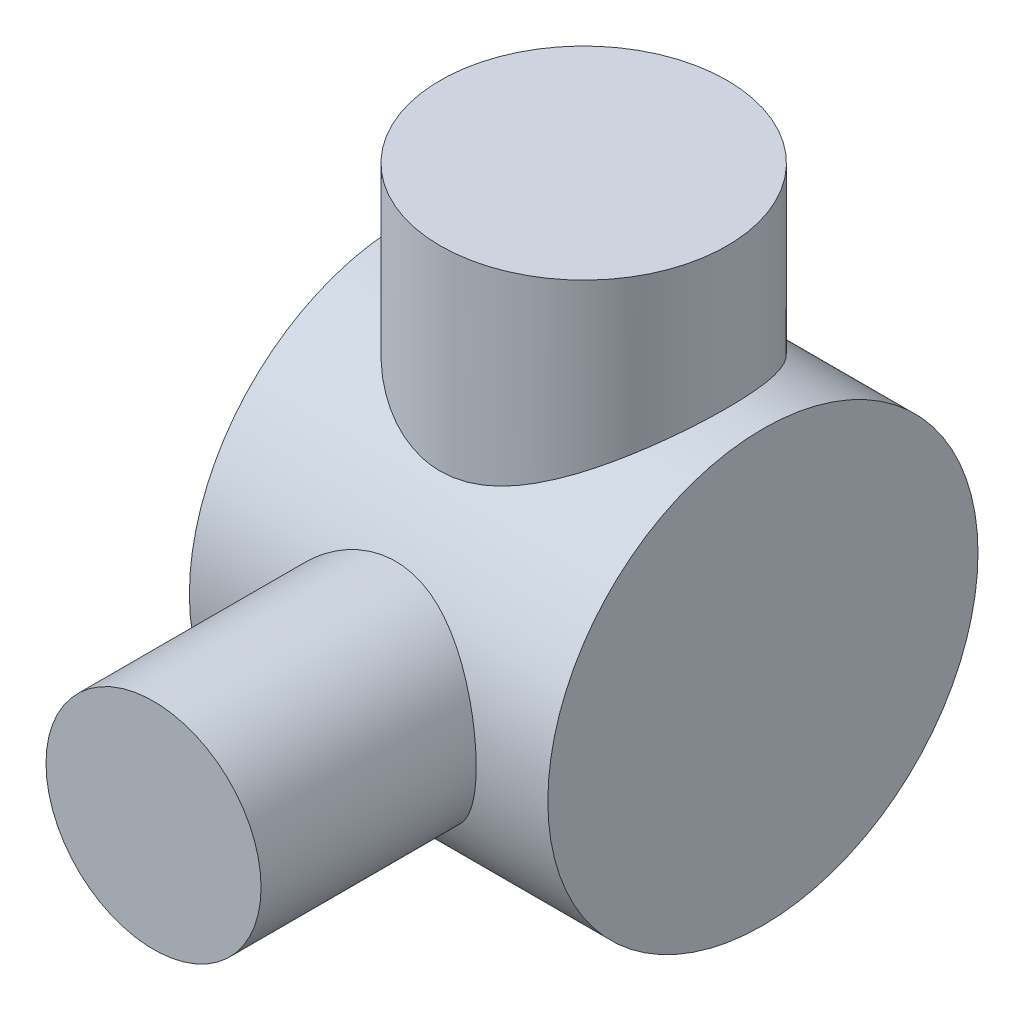
ISO-10303-21;
HEADER;
FILE_DESCRIPTION(('STEP AP214'),'2;1');
FILE_NAME('part.step','',(''),(''),'','','');
FILE_SCHEMA(('AUTOMOTIVE_DESIGN { 1 0 10303 214 1 1 1 1 }'));
ENDSEC;
DATA;
#1=APPLICATION_CONTEXT('core data for automotive mechanical design processes');
#2=APPLICATION_PROTOCOL_DEFINITION('international standard','automotive_design',2000,#1);
#3=PRODUCT_CONTEXT('',#1,'mechanical');
#4=PRODUCT('Part','Part','',(#3));
#5=PRODUCT_RELATED_PRODUCT_CATEGORY('part','',(#4));
#6=PRODUCT_DEFINITION_FORMATION('','',#4);
#7=PRODUCT_DEFINITION_CONTEXT('part definition',#1,'design');
#8=PRODUCT_DEFINITION('design','',#6,#7);
#9=PRODUCT_DEFINITION_SHAPE('','',#8);
#10=(LENGTH_UNIT() NAMED_UNIT(*) SI_UNIT(.MILLI.,.METRE.));
#11=(NAMED_UNIT(*) PLANE_ANGLE_UNIT() SI_UNIT($,.RADIAN.));
#12=(NAMED_UNIT(*) SI_UNIT($,.STERADIAN.) SOLID_ANGLE_UNIT());
#13=UNCERTAINTY_MEASURE_WITH_UNIT(LENGTH_MEASURE(1.E-05),#10,'distance_accuracy_value','');
#14=(GEOMETRIC_REPRESENTATION_CONTEXT(3) GLOBAL_UNCERTAINTY_ASSIGNED_CONTEXT((#13)) GLOBAL_UNIT_ASSIGNED_CONTEXT((#10,
#11,#12)) REPRESENTATION_CONTEXT('',''));
#15=CARTESIAN_POINT('',(0.,0.,0.));
#16=DIRECTION('',(0.,0.,1.));
#17=DIRECTION('',(1.,0.,0.));
#18=AXIS2_PLACEMENT_3D('',#15,#16,#17);
#19=CARTESIAN_POINT('',(0.,-50.,60.));
#20=DIRECTION('',(0.,0.,-1.));
#21=DIRECTION('',(-1.,0.,0.));
#22=AXIS2_PLACEMENT_3D('',#19,#20,#21);
#23=CYLINDRICAL_SURFACE('',#22,15.);
#24=CARTESIAN_POINT('',(0.,-50.,60.));
#25=DIRECTION('',(0.,0.,1.));
#26=DIRECTION('',(1.,0.,0.));
#27=AXIS2_PLACEMENT_3D('',#24,#25,#26);
#28=CIRCLE('',#27,15.);
#29=CARTESIAN_POINT('',(15.,-50.,60.));
#30=VERTEX_POINT('',#29);
#31=EDGE_CURVE('E11',#30,#30,#28,.T.);
#32=ORIENTED_EDGE('',*,*,#31,.F.);
#33=EDGE_LOOP('',(#32));
#34=FACE_BOUND('',#33,.T.);
#35=CARTESIAN_POINT('',(15.,-50.,29.9972154904954));
#36=CARTESIAN_POINT('',(14.9999989569117,-49.6068954014269,30.0025708522421));
#37=CARTESIAN_POINT('',(14.9845295123819,-49.2136627414613,30.0001834044916));
#38=CARTESIAN_POINT('',(14.9227783544598,-48.4298703688785,29.9800756600959));
#39=CARTESIAN_POINT('',(14.876483692889,-48.0393118492168,29.9623489192199));
#40=CARTESIAN_POINT('',(14.7534826368118,-47.2633382905676,29.912073871456));
#41=CARTESIAN_POINT('',(14.6767270639014,-46.8779326159672,29.8795015841057));
#42=CARTESIAN_POINT('',(14.4936538265207,-46.1157217811783,29.8004596578945));
#43=CARTESIAN_POINT('',(14.3873390216789,-45.7389157928501,29.7539913633328));
#44=CARTESIAN_POINT('',(14.1466892645879,-44.9977569546474,29.6485964235089));
#45=CARTESIAN_POINT('',(14.0124603619356,-44.6333628785264,29.5897169189796));
#46=CARTESIAN_POINT('',(13.7169944353529,-43.9177360106304,29.4608766035774));
#47=CARTESIAN_POINT('',(13.5557568384866,-43.5665034982454,29.3909155576333));
#48=CARTESIAN_POINT('',(13.2076811372139,-42.8792208762474,29.2416154302373));
#49=CARTESIAN_POINT('',(13.020851993918,-42.5431655067512,29.1622796327687));
#50=CARTESIAN_POINT('',(12.6228455298096,-41.8876091641929,28.9960010129632));
#51=CARTESIAN_POINT('',(12.4116586135258,-41.568114787479,28.9090551960191));
#52=CARTESIAN_POINT('',(11.9535809078084,-40.9294401936825,28.7243711256223));
#53=CARTESIAN_POINT('',(11.7053380463562,-40.6113257772543,28.6262999607597));
#54=CARTESIAN_POINT('',(11.1847318351996,-39.9968021929478,28.4262324494229));
#55=CARTESIAN_POINT('',(10.9123671046137,-39.7003942694571,28.324235878424));
#56=CARTESIAN_POINT('',(10.3448278255045,-39.1304852062085,28.1187457345628));
#57=CARTESIAN_POINT('',(10.0496401912575,-38.8569973979917,28.0152513309599));
#58=CARTESIAN_POINT('',(9.43797326936917,-38.3343875274729,27.8093792427744));
#59=CARTESIAN_POINT('',(9.12149006296054,-38.0852699705444,27.707001767777));
#60=CARTESIAN_POINT('',(8.44325665145162,-37.5943547143076,27.4981942905967));
#61=CARTESIAN_POINT('',(8.07990072555806,-37.3546393051382,27.3920699490561));
#62=CARTESIAN_POINT('',(7.33223896903544,-36.9069467951423,27.187654988409));
#63=CARTESIAN_POINT('',(6.94794188990345,-36.6989565720573,27.0893611385139));
#64=CARTESIAN_POINT('',(6.16051849684818,-36.3164502994685,26.9039854629751));
#65=CARTESIAN_POINT('',(5.75739655781988,-36.141926520038,26.8169010497582));
#66=CARTESIAN_POINT('',(4.93486257246805,-35.8281681161926,26.6572344182085));
#67=CARTESIAN_POINT('',(4.51545213989069,-35.6889300061622,26.5846507676007));
#68=CARTESIAN_POINT('',(3.6860691904766,-35.4539114566969,26.4603840007933));
#69=CARTESIAN_POINT('',(3.27677481981684,-35.3562186906283,26.4077969563355));
#70=CARTESIAN_POINT('',(2.44956087213642,-35.195367437884,26.3204577580377));
#71=CARTESIAN_POINT('',(2.03164161561104,-35.1322076703731,26.285704942726));
#72=CARTESIAN_POINT('',(1.19113989541962,-35.0413999992032,26.235549941696));
#73=CARTESIAN_POINT('',(0.768561457126202,-35.0137235449851,26.2201321988237));
#74=CARTESIAN_POINT('',(-0.0776610307218568,-34.994233233378,26.2092876499163));
#75=CARTESIAN_POINT('',(-0.501304979874221,-35.0024161148474,26.2138590260186));
#76=CARTESIAN_POINT('',(-1.2977996236505,-35.0515406874721,26.2411316059561));
#77=CARTESIAN_POINT('',(-1.67096621046526,-35.0886652170492,26.2617197159004));
#78=CARTESIAN_POINT('',(-2.41235045676477,-35.1905251540266,26.3177130358913));
#79=CARTESIAN_POINT('',(-2.78056854785173,-35.2552581371144,26.3531169449498));
#80=CARTESIAN_POINT('',(-3.50972132508105,-35.4116163333403,26.4375752528457));
#81=CARTESIAN_POINT('',(-3.87065428923304,-35.5032478267497,26.4866328394084));
#82=CARTESIAN_POINT('',(-4.58301874056562,-35.7124611049077,26.5968553309562));
#83=CARTESIAN_POINT('',(-4.9344497504026,-35.8300441906611,26.6580208429198));
#84=CARTESIAN_POINT('',(-5.6329987355544,-36.092757060446,26.7920212417417));
#85=CARTESIAN_POINT('',(-5.97988273323855,-36.2383995467559,26.8650686013772));
#86=CARTESIAN_POINT('',(-6.66026852302998,-36.5544952002418,27.0198732623772));
#87=CARTESIAN_POINT('',(-6.99376546633247,-36.7249572554756,27.101633681124));
#88=CARTESIAN_POINT('',(-7.64587546903434,-37.0895331392291,27.2717272823899));
#89=CARTESIAN_POINT('',(-7.96448615605696,-37.283650719991,27.3600615067794));
#90=CARTESIAN_POINT('',(-8.58552414750742,-37.6944157225287,27.541156769362));
#91=CARTESIAN_POINT('',(-8.88795021911412,-37.911064856898,27.6339181437664));
#92=CARTESIAN_POINT('',(-9.51064099740766,-38.3930743846969,27.8330083336058));
#93=CARTESIAN_POINT('',(-9.82870562037157,-38.661161221163,27.9396317330894));
#94=CARTESIAN_POINT('',(-10.4413726464484,-39.2226924809295,28.1528475611051));
#95=CARTESIAN_POINT('',(-10.7359833754121,-39.5161278279871,28.2594399871234));
#96=CARTESIAN_POINT('',(-11.3005296851683,-40.1272493620177,28.4699295288694));
#97=CARTESIAN_POINT('',(-11.5704442623711,-40.4449557773839,28.5738242974916));
#98=CARTESIAN_POINT('',(-12.0835466034642,-41.1027078895255,28.7760785919939));
#99=CARTESIAN_POINT('',(-12.3267451755861,-41.4427444627877,28.8744403483936));
#100=CARTESIAN_POINT('',(-12.794212769523,-42.1579334575695,29.0669610070332));
#101=CARTESIAN_POINT('',(-13.0172959634003,-42.533954194565,29.1607819622094));
#102=CARTESIAN_POINT('',(-13.4307410507582,-43.3061962971726,29.3369172421795));
#103=CARTESIAN_POINT('',(-13.621101567992,-43.7024185115081,29.4192310829812));
#104=CARTESIAN_POINT('',(-13.9669791284165,-44.5120902560911,29.5697715423726));
#105=CARTESIAN_POINT('',(-14.1225183445131,-44.9255286236506,29.6380071232896));
#106=CARTESIAN_POINT('',(-14.3970300367979,-45.7666595959361,29.7582388426173));
#107=CARTESIAN_POINT('',(-14.5160066118705,-46.1943505968963,29.8102368013704));
#108=CARTESIAN_POINT('',(-14.7075656244971,-47.0244864486464,29.8926576750092));
#109=CARTESIAN_POINT('',(-14.7831713445805,-47.426093708127,29.9245093153259));
#110=CARTESIAN_POINT('',(-14.901413495337,-48.2350789289139,29.9720683562507));
#111=CARTESIAN_POINT('',(-14.9440517422207,-48.6424565710648,29.9877766462276));
#112=CARTESIAN_POINT('',(-14.9958442567246,-49.4594845282909,30.0024918965135));
#113=CARTESIAN_POINT('',(-15.0050108397015,-49.8691339519287,30.001505000299));
#114=CARTESIAN_POINT('',(-14.98982623326,-50.6874170052564,29.9827602397182));
#115=CARTESIAN_POINT('',(-14.9654763411347,-51.096050673649,29.9650030244744));
#116=CARTESIAN_POINT('',(-14.8866384198081,-51.8792020087867,29.9150116467968));
#117=CARTESIAN_POINT('',(-14.8344818898005,-52.2540312794483,29.8839297679727));
#118=CARTESIAN_POINT('',(-14.7023261890891,-52.9973464932977,29.8083572611299));
#119=CARTESIAN_POINT('',(-14.622328715719,-53.3658328217484,29.763867450553));
#120=CARTESIAN_POINT('',(-14.4353499535458,-54.0941477662548,29.6624219497396));
#121=CARTESIAN_POINT('',(-14.3283668814048,-54.4539758084072,29.6054654356763));
#122=CARTESIAN_POINT('',(-14.0884676228051,-55.1628592615009,29.4802803364628));
#123=CARTESIAN_POINT('',(-13.9555503094911,-55.5119142035822,29.4120512615341));
#124=CARTESIAN_POINT('',(-13.6601136488889,-56.2088049615408,29.2632760880622));
#125=CARTESIAN_POINT('',(-13.4967566565747,-56.5562139559409,29.182395757922));
#126=CARTESIAN_POINT('',(-13.1449482659923,-57.2357967321132,29.0117893473974));
#127=CARTESIAN_POINT('',(-12.9564965677427,-57.5679703316982,28.9220631612733));
#128=CARTESIAN_POINT('',(-12.5558066283883,-58.2156409673905,28.7355835149231));
#129=CARTESIAN_POINT('',(-12.3435643283835,-58.5311351442783,28.6388288565677));
#130=CARTESIAN_POINT('',(-11.8965385522114,-59.1441983001853,28.4402071814561));
#131=CARTESIAN_POINT('',(-11.6617463067084,-59.4417602318156,28.3383381832195));
#132=CARTESIAN_POINT('',(-11.1461179484247,-60.0467693814406,28.1210939651804));
#133=CARTESIAN_POINT('',(-10.8630264878877,-60.3521807809445,28.0053936141675));
#134=CARTESIAN_POINT('',(-10.272641684476,-60.9382755530498,27.7730946558694));
#135=CARTESIAN_POINT('',(-9.96534728444968,-61.2189578443816,27.6564960095487));
#136=CARTESIAN_POINT('',(-9.32784130549257,-61.7543500169981,27.4252528868164));
#137=CARTESIAN_POINT('',(-8.99761498977736,-62.0090429321893,27.310609727115));
#138=CARTESIAN_POINT('',(-8.31587332077414,-62.4908167108045,27.086384707629));
#139=CARTESIAN_POINT('',(-7.96435426147281,-62.7178927466894,26.9768037348048));
#140=CARTESIAN_POINT('',(-7.22434465151555,-63.1530142135785,26.7608074889032));
#141=CARTESIAN_POINT('',(-6.83488952564232,-63.3596249618578,26.6547959839121));
#142=CARTESIAN_POINT('',(-6.03678567229736,-63.7387140587384,26.4555401980544));
#143=CARTESIAN_POINT('',(-5.62814667747051,-63.9112094885469,26.3622895352009));
#144=CARTESIAN_POINT('',(-4.79452077657432,-64.2200543179705,26.1921681356698));
#145=CARTESIAN_POINT('',(-4.36954902463067,-64.3564363400097,26.1152826282148));
#146=CARTESIAN_POINT('',(-3.50625093033535,-64.5913058016946,25.9810930830933));
#147=CARTESIAN_POINT('',(-3.06792687577853,-64.6897996941493,25.9237857112186));
#148=CARTESIAN_POINT('',(-2.22772323072489,-64.8391393556824,25.8361966390071));
#149=CARTESIAN_POINT('',(-1.82675638020605,-64.8938562317353,25.8037346666746));
#150=CARTESIAN_POINT('',(-1.02062424433856,-64.9707117977216,25.7580027468101));
#151=CARTESIAN_POINT('',(-0.615459271677861,-64.992852896673,25.7447313801108));
#152=CARTESIAN_POINT('',(0.195339199194535,-65.0042052780371,25.737936354253));
#153=CARTESIAN_POINT('',(0.600972461131193,-64.993429059115,25.7444051997594));
#154=CARTESIAN_POINT('',(1.40924303792178,-64.9391457323886,25.7768037205944));
#155=CARTESIAN_POINT('',(1.811880479762,-64.8956400199906,25.802732566255));
#156=CARTESIAN_POINT('',(2.57030776843869,-64.7826025140205,25.8694243597698));
#157=CARTESIAN_POINT('',(2.92671856599035,-64.7161465368179,25.9084226142114));
#158=CARTESIAN_POINT('',(3.63224302213325,-64.5580745953734,26.0000578419603));
#159=CARTESIAN_POINT('',(3.98135424263529,-64.4664503648501,26.0526992959294));
#160=CARTESIAN_POINT('',(4.67020086081633,-64.2589842583882,26.170063948461));
#161=CARTESIAN_POINT('',(5.00993614085949,-64.1431420787537,26.2347872985307));
#162=CARTESIAN_POINT('',(5.67841107219412,-63.8882552081821,26.3745566023493));
#163=CARTESIAN_POINT('',(6.00714959260116,-63.7492081396535,26.4496036137301));
#164=CARTESIAN_POINT('',(6.67510074271698,-63.4383103704426,26.6137638350077));
#165=CARTESIAN_POINT('',(7.01340356561298,-63.2648328861862,26.7034970832649));
#166=CARTESIAN_POINT('',(7.6743524914602,-62.8937187176262,26.8902941079064));
#167=CARTESIAN_POINT('',(7.99699808580688,-62.6960812492501,26.9873581221595));
#168=CARTESIAN_POINT('',(8.6255173145998,-62.2777446849133,27.1865215732227));
#169=CARTESIAN_POINT('',(8.93138444586255,-62.0570367420045,27.2886229337454));
#170=CARTESIAN_POINT('',(9.52511554743777,-61.5937054874614,27.495560622341));
#171=CARTESIAN_POINT('',(9.81297679942774,-61.3510788802464,27.6003973600006));
#172=CARTESIAN_POINT('',(10.4057416996382,-60.8120844081361,27.8242534750944));
#173=CARTESIAN_POINT('',(10.7080002259481,-60.5128298881501,27.943345809593));
#174=CARTESIAN_POINT('',(11.2863605034476,-59.889329216166,28.1790872694705));
#175=CARTESIAN_POINT('',(11.5624701252884,-59.5650906378411,28.295737121734));
#176=CARTESIAN_POINT('',(12.087160686653,-58.8928334749742,28.5237958028068));
#177=CARTESIAN_POINT('',(12.3357183760129,-58.5447952010809,28.6352001602016));
#178=CARTESIAN_POINT('',(12.8031984532899,-57.8269750346453,28.8498426326209));
#179=CARTESIAN_POINT('',(13.0221224151227,-57.4571942983928,28.9530811812292));
#180=CARTESIAN_POINT('',(13.4310991757153,-56.6929681920262,29.1500178036274));
#181=CARTESIAN_POINT('',(13.6207374466098,-56.2982637165288,29.2435736240801));
#182=CARTESIAN_POINT('',(13.9656761087534,-55.491129276654,29.4170357912001));
#183=CARTESIAN_POINT('',(14.1209714314347,-55.0786967065568,29.4969401226918));
#184=CARTESIAN_POINT('',(14.3949302973673,-54.2402812339752,29.6406325187965));
#185=CARTESIAN_POINT('',(14.5136858354339,-53.8143353892334,29.7044609821771));
#186=CARTESIAN_POINT('',(14.7133827962728,-52.9516426902649,29.8143710837149));
#187=CARTESIAN_POINT('',(14.7943474394066,-52.5149026426477,29.8604636165297));
#188=CARTESIAN_POINT('',(14.9037151462592,-51.7318241846456,29.9255163850808));
#189=CARTESIAN_POINT('',(14.939780995083,-51.3868443847448,29.9482220842433));
#190=CARTESIAN_POINT('',(14.987924372296,-50.6946097808095,29.9817058293405));
#191=CARTESIAN_POINT('',(15.0000009216932,-50.3473548845096,29.9924833884854));
#192=CARTESIAN_POINT('',(15.,-50.,29.9972154904954));
#193=B_SPLINE_CURVE_WITH_KNOTS('',3,(#35,#36,#37,#38,#39,#40,#41,#42,#43,#44,#45,#46,#47,#48,
#49,#50,#51,#52,#53,#54,#55,#56,#57,#58,#59,#60,#61,#62,#63,#64,#65,#66,#67,#68,#69,#70,#71,#72,
#73,#74,#75,#76,#77,#78,#79,#80,#81,#82,#83,#84,#85,#86,#87,#88,#89,#90,#91,#92,#93,#94,#95,#96,
#97,#98,#99,#100,#101,#102,#103,#104,#105,#106,#107,#108,#109,#110,#111,#112,#113,#114,#115,
#116,#117,#118,#119,#120,#121,#122,#123,#124,#125,#126,#127,#128,#129,#130,#131,#132,#133,#134,
#135,#136,#137,#138,#139,#140,#141,#142,#143,#144,#145,#146,#147,#148,#149,#150,#151,#152,#153,
#154,#155,#156,#157,#158,#159,#160,#161,#162,#163,#164,#165,#166,#167,#168,#169,#170,#171,#172,
#173,#174,#175,#176,#177,#178,#179,#180,#181,#182,#183,#184,#185,#186,#187,#188,#189,#190,#191,
#192),.UNSPECIFIED.,.T.,.F.,(4,2,2,2,2,2,2,2,2,2,2,2,2,2,2,2,2,2,2,2,2,2,2,2,2,2,2,2,2,2,2,2,2,
2,2,2,2,2,2,2,2,2,2,2,2,2,2,2,2,2,2,2,2,2,2,2,2,2,2,2,2,2,2,2,2,2,2,2,2,2,2,2,2,2,2,2,2,2,4),
(0.,1.17908335427363,2.35866229698041,3.54015343969378,4.72153032196537,5.89849840112798,
7.07549145049841,8.25207341370453,9.42912047154236,10.6735742773057,11.9180993692248,
13.1633433895529,14.4088171871237,15.7513221879152,17.0932703834644,18.4349082475963,
19.7764135293446,21.046810152002,22.3171596522256,23.5864863618998,24.8556976380862,
25.981087267028,27.1063780952719,28.2319318659673,29.3575420757245,30.5060990505968,
31.6550683478379,32.8042201325282,33.9534593266481,35.2403083671146,36.5266985355257,
37.8141727769526,39.1011242243232,40.4408704594661,41.7806730277313,43.1196200176606,
44.458416849056,45.6864850263602,46.9144855433595,48.1420341919031,49.3695353281269,
50.50736860323,51.6451325220478,52.7829716494765,53.9208602275844,55.0966014573627,
56.27235674318,57.4483129300861,58.6247282948434,59.919933572208,61.2151954537872,
62.5112975558469,63.8076258970002,65.1661154512646,66.5239230914529,67.8804999625857,
69.2368456897924,70.4530772603997,71.6692188846953,72.884898798922,74.1005268861524,
75.1932585156192,76.286349472756,77.3794541381966,78.472670872857,79.6433941052496,
80.814155341629,81.9853671941586,83.1567554382665,84.480338566505,85.803522030107,
87.1278137178859,88.4520350418559,89.7935556737476,91.135274164509,92.4735864871346,
93.811075406708,94.8528939224389,95.8947549534152),.UNSPECIFIED.);
#194=CARTESIAN_POINT('',(15.,-50.,29.9972154904954));
#195=VERTEX_POINT('',#194);
#196=EDGE_CURVE('E47',#195,#195,#193,.T.);
#197=ORIENTED_EDGE('',*,*,#196,.T.);
#198=EDGE_LOOP('',(#197));
#199=FACE_BOUND('',#198,.T.);
#200=ADVANCED_FACE('F41',(#34,#199),#23,.T.);
#201=CARTESIAN_POINT('',(0.,-50.,60.));
#202=DIRECTION('',(0.,0.,1.));
#203=DIRECTION('',(1.,0.,0.));
#204=AXIS2_PLACEMENT_3D('',#201,#202,#203);
#205=PLANE('',#204);
#206=ORIENTED_EDGE('',*,*,#31,.T.);
#207=EDGE_LOOP('',(#206));
#208=FACE_BOUND('',#207,.T.);
#209=ADVANCED_FACE('F62',(#208),#205,.T.);
#210=CARTESIAN_POINT('',(25.,-49.5912668146794,0.));
#211=DIRECTION('',(-1.,0.,0.));
#212=DIRECTION('',(0.,0.,1.));
#213=AXIS2_PLACEMENT_3D('',#210,#211,#212);
#214=CYLINDRICAL_SURFACE('',#213,30.);
#215=ORIENTED_EDGE('',*,*,#196,.F.);
#216=EDGE_LOOP('',(#215));
#217=FACE_BOUND('',#216,.T.);
#218=ADVANCED_FACE('F59',(#217),#214,.F.);
#219=CLOSED_SHELL('',(#200,#209,#218));
#220=MANIFOLD_SOLID_BREP('B2',#219);
#221=CARTESIAN_POINT('',(25.,-49.5912668146794,0.));
#222=DIRECTION('',(-1.,0.,0.));
#223=DIRECTION('',(0.,0.,1.));
#224=AXIS2_PLACEMENT_3D('',#221,#222,#223);
#225=CYLINDRICAL_SURFACE('',#224,30.);
#226=CARTESIAN_POINT('',(0.,-27.2305870396815,20.));
#227=CARTESIAN_POINT('',(0.488208956169302,-27.2305809211505,19.9999964119226));
#228=CARTESIAN_POINT('',(0.976468291774057,-27.2145252423223,19.9820866285813));
#229=CARTESIAN_POINT('',(1.94835881250643,-27.1511074061699,19.9108373861768));
#230=CARTESIAN_POINT('',(2.43198924712352,-27.1037402565311,19.8574922772833));
#231=CARTESIAN_POINT('',(3.39112332136817,-26.9799171207591,19.7163799196857));
#232=CARTESIAN_POINT('',(3.8666135294044,-26.9034171452232,19.6285606101056));
#233=CARTESIAN_POINT('',(4.80533737323533,-26.7247233648398,19.4200919600602));
#234=CARTESIAN_POINT('',(5.26857077190595,-26.6225290633029,19.2994419849513));
#235=CARTESIAN_POINT('',(6.17578513914899,-26.3975385876904,19.0284426273943));
#236=CARTESIAN_POINT('',(6.6199111296105,-26.2749559942888,18.8783985352891));
#237=CARTESIAN_POINT('',(7.49212487931457,-26.0124866307579,18.5495380856482));
#238=CARTESIAN_POINT('',(7.92020999413462,-25.8725970236859,18.3707170095788));
#239=CARTESIAN_POINT('',(8.75912421482544,-25.5794412210806,17.9858478768931));
#240=CARTESIAN_POINT('',(9.16995442032433,-25.4261758798835,17.7798015587787));
#241=CARTESIAN_POINT('',(9.97362051230805,-25.10991429055,17.3417522052945));
#242=CARTESIAN_POINT('',(10.3664551510918,-24.9469173694854,17.1097473739498));
#243=CARTESIAN_POINT('',(11.1932268211757,-24.5886931357194,16.5827611461459));
#244=CARTESIAN_POINT('',(11.6240409428177,-24.3923988340297,16.2835985891376));
#245=CARTESIAN_POINT('',(12.4598274059487,-23.996112365056,15.6533280846079));
#246=CARTESIAN_POINT('',(12.8647979980787,-23.7961199486244,15.3222179783466));
#247=CARTESIAN_POINT('',(13.6481434866574,-23.3966448208004,14.6288076134715));
#248=CARTESIAN_POINT('',(14.0264936382841,-23.1971627454929,14.2664790139786));
#249=CARTESIAN_POINT('',(14.7548145893199,-22.8030081749833,13.5118632099609));
#250=CARTESIAN_POINT('',(15.1047834311923,-22.6083360121768,13.1195739425843));
#251=CARTESIAN_POINT('',(15.8231340954399,-22.2001736683137,12.2471310095378));
#252=CARTESIAN_POINT('',(16.1868495528045,-21.9880379616431,11.7624780965832));
#253=CARTESIAN_POINT('',(16.8717372344808,-21.5809167469099,10.7570654072488));
#254=CARTESIAN_POINT('',(17.1929043262227,-21.3859333088611,10.2363012863295));
#255=CARTESIAN_POINT('',(17.7887598687195,-21.0188156701959,9.1617184714881));
#256=CARTESIAN_POINT('',(18.0634871779264,-20.8466623927153,8.60792794262455));
#257=CARTESIAN_POINT('',(18.5627727588207,-20.5303099387493,7.47053849984761));
#258=CARTESIAN_POINT('',(18.7873417767955,-20.3861047753284,6.88694600391358));
#259=CARTESIAN_POINT('',(19.1602240381012,-20.1447668592771,5.76165832972233));
#260=CARTESIAN_POINT('',(19.3142641521887,-20.0441690751117,5.22260227045826));
#261=CARTESIAN_POINT('',(19.5772038937651,-19.8716261019477,4.12906673821278));
#262=CARTESIAN_POINT('',(19.6861065662819,-19.7996789801527,3.57458830833749));
#263=CARTESIAN_POINT('',(19.8566974647913,-19.6866793057374,2.45588842993637));
#264=CARTESIAN_POINT('',(19.9184351137685,-19.6455944141572,1.89167781543662));
#265=CARTESIAN_POINT('',(19.9936647349202,-19.5955035105127,0.758659088769599));
#266=CARTESIAN_POINT('',(20.007163514351,-19.5864929722579,0.189851636642885));
#267=CARTESIAN_POINT('',(19.9873184370662,-19.5997194164941,-0.859806415927934));
#268=CARTESIAN_POINT('',(19.9607940358833,-19.6174074507638,-1.34086232409546));
#269=CARTESIAN_POINT('',(19.873310019839,-19.6755958254053,-2.2983895351906));
#270=CARTESIAN_POINT('',(19.8123548499873,-19.7160932210882,-2.77486142184121));
#271=CARTESIAN_POINT('',(19.6568520909165,-19.818990365845,-3.7198828753724));
#272=CARTESIAN_POINT('',(19.5623030441721,-19.8813910652282,-4.18843209759108));
#273=CARTESIAN_POINT('',(19.3408382238798,-20.0267433641159,-5.11455664152083));
#274=CARTESIAN_POINT('',(19.2139210515152,-20.1096958517795,-5.57213148802944));
#275=CARTESIAN_POINT('',(18.9298040334637,-20.2940681143948,-6.47179810816159));
#276=CARTESIAN_POINT('',(18.7727295883957,-20.3954113241882,-6.91394533614489));
#277=CARTESIAN_POINT('',(18.4296096664266,-20.6148432881785,-7.78251525709053));
#278=CARTESIAN_POINT('',(18.2435647019401,-20.7329317461914,-8.20893822800989));
#279=CARTESIAN_POINT('',(17.8441778455769,-20.9837410420399,-9.04431763466509));
#280=CARTESIAN_POINT('',(17.6308352556287,-21.1164622540612,-9.45327362336784));
#281=CARTESIAN_POINT('',(17.1784769804029,-21.3943128147361,-10.2523545489443));
#282=CARTESIAN_POINT('',(16.9394582795807,-21.5394436204318,-10.6424772661187));
#283=CARTESIAN_POINT('',(16.4042840153249,-21.8595400744991,-11.4527356062426));
#284=CARTESIAN_POINT('',(16.1047473885238,-22.0359204429262,-11.8700812163928));
#285=CARTESIAN_POINT('',(15.4767499308217,-22.3981796661018,-12.6780149842778));
#286=CARTESIAN_POINT('',(15.1482869484778,-22.5840592269354,-13.0686011478891));
#287=CARTESIAN_POINT('',(14.463625347029,-22.9620562746301,-13.8225619123957));
#288=CARTESIAN_POINT('',(14.107387635318,-23.154182323408,-14.185896693865));
#289=CARTESIAN_POINT('',(13.3689696755022,-23.5407317078739,-14.883843396687));
#290=CARTESIAN_POINT('',(12.9867881329827,-23.735155157786,-15.2184538830105));
#291=CARTESIAN_POINT('',(12.1362208652914,-24.1525180804532,-15.9077512722913));
#292=CARTESIAN_POINT('',(11.6636681752519,-24.3751939742117,-16.2574779985587));
#293=CARTESIAN_POINT('',(10.6867448691347,-24.8119302331281,-16.9156894234147));
#294=CARTESIAN_POINT('',(10.1823671315698,-25.0259886522759,-17.2241648426867));
#295=CARTESIAN_POINT('',(9.14376134489059,-25.4379731481642,-17.7972680129957));
#296=CARTESIAN_POINT('',(8.60957393087465,-25.635920323222,-18.0619535936899));
#297=CARTESIAN_POINT('',(7.78719238261373,-25.9148243858878,-18.4241508744694));
#298=CARTESIAN_POINT('',(7.50958963683993,-26.0047780560123,-18.539064186288));
#299=CARTESIAN_POINT('',(6.94749503984161,-26.1776779421092,-18.7569503816948));
#300=CARTESIAN_POINT('',(6.66300152644,-26.2606224452431,-18.8599203489511));
#301=CARTESIAN_POINT('',(5.96407091868975,-26.4522553955149,-19.0949737019528));
#302=CARTESIAN_POINT('',(5.54626140545961,-26.5567168743057,-19.2205883140043));
#303=CARTESIAN_POINT('',(4.69922231908342,-26.745865395434,-19.4450303060951));
#304=CARTESIAN_POINT('',(4.26999589657128,-26.8305578314856,-19.5438649938583));
#305=CARTESIAN_POINT('',(3.40278811100768,-26.9771852883076,-19.7133430846625));
#306=CARTESIAN_POINT('',(2.96482019952331,-27.0391528013828,-19.78402675084));
#307=CARTESIAN_POINT('',(2.08233638909669,-27.1381168058525,-19.8962732778957));
#308=CARTESIAN_POINT('',(1.63782046369869,-27.1751131963287,-19.9378360210846));
#309=CARTESIAN_POINT('',(0.743602003114595,-27.222700164468,-19.9912114344644));
#310=CARTESIAN_POINT('',(0.293885240116605,-27.2331735760933,-20.0028921020166));
#311=CARTESIAN_POINT('',(-0.605120297999129,-27.226917505966,-19.9958970388908));
#312=CARTESIAN_POINT('',(-1.05440907208809,-27.2101879589883,-19.9772212354264));
#313=CARTESIAN_POINT('',(-1.9492428602337,-27.1502314324953,-19.9098452800438));
#314=CARTESIAN_POINT('',(-2.39478497674719,-27.1069855697949,-19.8611237313693));
#315=CARTESIAN_POINT('',(-3.27854030433162,-26.9957674500442,-19.7344995148557));
#316=CARTESIAN_POINT('',(-3.71675339276235,-26.9277947796602,-19.6565963592159));
#317=CARTESIAN_POINT('',(-4.56177482159982,-26.7736043026192,-19.4773587360434));
#318=CARTESIAN_POINT('',(-4.9690663661839,-26.6884511402437,-19.3773687153742));
#319=CARTESIAN_POINT('',(-5.7729769048643,-26.5006971646416,-19.1532490632813));
#320=CARTESIAN_POINT('',(-6.16959170710487,-26.3980896110113,-19.0291101035355));
#321=CARTESIAN_POINT('',(-6.95065639455215,-26.1782114924812,-18.7579126655137));
#322=CARTESIAN_POINT('',(-7.3351071776239,-26.0609420130035,-18.6108558836455));
#323=CARTESIAN_POINT('',(-8.09100392305641,-25.8144578659188,-18.2949037795792));
#324=CARTESIAN_POINT('',(-8.46244798787664,-25.685241465312,-18.1260052876392));
#325=CARTESIAN_POINT('',(-9.26453201163456,-25.3907311680085,-17.731501269301));
#326=CARTESIAN_POINT('',(-9.69216720830649,-25.2233880159583,-17.5013086005028));
#327=CARTESIAN_POINT('',(-10.5268797585094,-24.8795178617192,-17.0123139239897));
#328=CARTESIAN_POINT('',(-10.9339551810086,-24.702990000026,-16.7535092362064));
#329=CARTESIAN_POINT('',(-11.7272393872389,-24.3444287982644,-16.2081390990384));
#330=CARTESIAN_POINT('',(-12.1134251136209,-24.1623897072098,-15.9215439116551));
#331=CARTESIAN_POINT('',(-12.863686505644,-23.7965545824037,-15.3217576930428));
#332=CARTESIAN_POINT('',(-13.2277606863969,-23.6127584316149,-15.0085648790455));
#333=CARTESIAN_POINT('',(-14.010022924438,-23.2066919562496,-14.2850209466698));
#334=CARTESIAN_POINT('',(-14.4226354817809,-22.9847969069265,-13.868399953091));
#335=CARTESIAN_POINT('',(-15.2116275793937,-22.5489758122202,-12.9981303927617));
#336=CARTESIAN_POINT('',(-15.5880004523266,-22.3350512376576,-12.5444750407321));
#337=CARTESIAN_POINT('',(-16.3015809622043,-21.9207548110288,-11.6020484650165));
#338=CARTESIAN_POINT('',(-16.6388155779588,-21.7203736634699,-11.1133018111967));
#339=CARTESIAN_POINT('',(-17.2712189380549,-21.3382752030491,-10.1024838029969));
#340=CARTESIAN_POINT('',(-17.5663989619658,-21.1565528893201,-9.58042143890714));
#341=CARTESIAN_POINT('',(-18.0588559388184,-20.849437610601,-8.60898698059616));
#342=CARTESIAN_POINT('',(-18.2640476187588,-20.7199294198643,-8.16491313347023));
#343=CARTESIAN_POINT('',(-18.6427436665588,-20.4788888837094,-7.25872966066563));
#344=CARTESIAN_POINT('',(-18.8162516453839,-20.3673544900026,-6.79662209756982));
#345=CARTESIAN_POINT('',(-19.1295452645597,-20.1646590805111,-5.8570926543953));
#346=CARTESIAN_POINT('',(-19.2693535082187,-20.0734844119547,-5.37968128385402));
#347=CARTESIAN_POINT('',(-19.5136219644057,-19.913448143419,-4.41219358714587));
#348=CARTESIAN_POINT('',(-19.6180816641359,-19.8445868671384,-3.92211707735807));
#349=CARTESIAN_POINT('',(-19.7905605262366,-19.7305556170136,-2.93054121015943));
#350=CARTESIAN_POINT('',(-19.8584133272705,-19.6854938199135,-2.42900032455899));
#351=CARTESIAN_POINT('',(-19.9559150035461,-19.6206609907979,-1.42057881685205));
#352=CARTESIAN_POINT('',(-19.985563818304,-19.6008899988224,-0.913698186293017));
#353=CARTESIAN_POINT('',(-20.0061827922548,-19.5871455747307,0.101169392531049));
#354=CARTESIAN_POINT('',(-19.9971552556599,-19.5931706057707,0.609156273087099));
#355=CARTESIAN_POINT('',(-19.9405705458765,-19.6308611894106,1.6219998853204));
#356=CARTESIAN_POINT('',(-19.8930151261764,-19.6625255751073,2.12685675839747));
#357=CARTESIAN_POINT('',(-19.7649794259347,-19.7474682488586,3.09279975247605));
#358=CARTESIAN_POINT('',(-19.687150146037,-19.7990038896511,3.55439520403423));
#359=CARTESIAN_POINT('',(-19.5000321223317,-19.9223217622831,4.46836902451358));
#360=CARTESIAN_POINT('',(-19.3907452072019,-19.9941028172224,4.92074792756969));
#361=CARTESIAN_POINT('',(-19.1419956701691,-20.1564723529666,5.81367709229976));
#362=CARTESIAN_POINT('',(-19.0025311498945,-20.2470620169434,6.25422660786602));
#363=CARTESIAN_POINT('',(-18.6949126651676,-20.4453248337452,7.12122590088722));
#364=CARTESIAN_POINT('',(-18.5267571866793,-20.552998888101,7.54767493283414));
#365=CARTESIAN_POINT('',(-18.1528283168397,-20.7901716237267,8.40878779714676));
#366=CARTESIAN_POINT('',(-17.9454426246028,-20.9205719259713,8.84250227551099));
#367=CARTESIAN_POINT('',(-17.5022026754717,-21.1958986070089,9.69029143409239));
#368=CARTESIAN_POINT('',(-17.2663476127158,-21.3408253969729,10.104365557902));
#369=CARTESIAN_POINT('',(-16.7678351398796,-21.6427260738649,10.9116855558948));
#370=CARTESIAN_POINT('',(-16.5051663004555,-21.799705090915,11.3049224388242));
#371=CARTESIAN_POINT('',(-15.9547049296104,-22.1230489490162,12.0693531593152));
#372=CARTESIAN_POINT('',(-15.6669095826824,-22.2894148411565,12.4405445187535));
#373=CARTESIAN_POINT('',(-15.0204704992175,-22.6555508949553,13.2166207315212));
#374=CARTESIAN_POINT('',(-14.6578028483683,-22.8564595571703,13.6176230440809));
#375=CARTESIAN_POINT('',(-13.9025385930368,-23.2629691569454,14.3878567191196));
#376=CARTESIAN_POINT('',(-13.5099380886709,-23.4685707034775,14.757083928306));
#377=CARTESIAN_POINT('',(-12.6960054650691,-23.8800794379113,15.4629181005339));
#378=CARTESIAN_POINT('',(-12.2746525915669,-24.0859867393641,15.7995010665117));
#379=CARTESIAN_POINT('',(-11.4046784566367,-24.4930814068983,16.4385088149114));
#380=CARTESIAN_POINT('',(-10.9560598425279,-24.6942692285886,16.7409369054171));
#381=CARTESIAN_POINT('',(-10.0678167363029,-25.0716440891334,17.288437587054));
#382=CARTESIAN_POINT('',(-9.63011792851659,-25.2485674137517,17.536125801145));
#383=CARTESIAN_POINT('',(-8.7331555306482,-25.5892683454687,17.9996334824726));
#384=CARTESIAN_POINT('',(-8.27389129214839,-25.7530455568953,18.2154519906584));
#385=CARTESIAN_POINT('',(-7.33576452239174,-26.0621854892295,18.6130511835398));
#386=CARTESIAN_POINT('',(-6.8569347106357,-26.2075774123938,18.7948860714089));
#387=CARTESIAN_POINT('',(-5.88083845965279,-26.4749469136751,19.1227764985235));
#388=CARTESIAN_POINT('',(-5.38357708340433,-26.5969308656996,19.268841780706));
#389=CARTESIAN_POINT('',(-4.4853911912487,-26.7883909529424,19.4947592055363));
#390=CARTESIAN_POINT('',(-4.08754467830019,-26.8635125142011,19.5821115045836));
#391=CARTESIAN_POINT('',(-3.28415884670264,-26.9941712771172,19.7327455746581));
#392=CARTESIAN_POINT('',(-2.8786207162801,-27.0497114782143,19.7960310323203));
#393=CARTESIAN_POINT('',(-2.06234621278792,-27.1393431343751,19.8976315087765));
#394=CARTESIAN_POINT('',(-1.65161370745007,-27.1734496884151,19.9359641063474));
#395=CARTESIAN_POINT('',(-0.827266419755447,-27.2190756054216,19.9871514199303));
#396=CARTESIAN_POINT('',(-0.413651293298562,-27.2305922238105,20.0000030401181));
#397=CARTESIAN_POINT('',(0.,-27.2305870396815,20.));
#398=B_SPLINE_CURVE_WITH_KNOTS('',3,(#226,#227,#228,#229,#230,#231,#232,#233,#234,#235,#236,
#237,#238,#239,#240,#241,#242,#243,#244,#245,#246,#247,#248,#249,#250,#251,#252,#253,#254,#255,
#256,#257,#258,#259,#260,#261,#262,#263,#264,#265,#266,#267,#268,#269,#270,#271,#272,#273,#274,
#275,#276,#277,#278,#279,#280,#281,#282,#283,#284,#285,#286,#287,#288,#289,#290,#291,#292,#293,
#294,#295,#296,#297,#298,#299,#300,#301,#302,#303,#304,#305,#306,#307,#308,#309,#310,#311,#312,
#313,#314,#315,#316,#317,#318,#319,#320,#321,#322,#323,#324,#325,#326,#327,#328,#329,#330,#331,
#332,#333,#334,#335,#336,#337,#338,#339,#340,#341,#342,#343,#344,#345,#346,#347,#348,#349,#350,
#351,#352,#353,#354,#355,#356,#357,#358,#359,#360,#361,#362,#363,#364,#365,#366,#367,#368,#369,
#370,#371,#372,#373,#374,#375,#376,#377,#378,#379,#380,#381,#382,#383,#384,#385,#386,#387,#388,
#389,#390,#391,#392,#393,#394,#395,#396,#397),.UNSPECIFIED.,.T.,.F.,(4,2,2,2,2,2,2,2,2,2,2,2,2,
2,2,2,2,2,2,2,2,2,2,2,2,2,2,2,2,2,2,2,2,2,2,2,2,2,2,2,2,2,2,2,2,2,2,2,2,2,2,2,2,2,2,2,2,2,2,2,2,
2,2,2,2,2,2,2,2,2,2,2,2,2,2,2,2,2,2,2,2,2,2,2,2,4),(0.,1.46413383476119,2.92850116798433,
4.3950884612604,5.86170410688106,7.31382579475252,8.76618582863999,10.2184531650402,
11.6708210407287,13.3493094048912,15.0279112663608,16.7080533902126,18.3883112996803,
20.3117642438544,22.2354490015051,24.1575160629544,26.0791709305319,27.7853619359246,
29.4914378208096,31.1957234922769,32.8997686529781,34.3443503382155,35.7887455706705,
37.2332034782288,38.6777238198782,40.1163627603301,41.5549762578204,42.9936265517613,
44.4324459938663,46.0602839475324,47.6882430766068,49.3185364037738,50.9489111309836,
52.8326361759336,54.7167842470655,56.5984238649026,57.5389749114896,58.4797551409555,
59.8242529017226,61.1683834046849,62.5105844944299,63.8527910085193,65.2009164973756,
66.5490452186684,67.8981351058559,69.2472475454816,70.529851328563,71.8129515469024,
73.0959568335221,74.3791485235474,75.9187799981372,77.4585558113539,78.9999978795721,
80.5415433482356,82.4201756779315,84.2991529785492,86.1768272700558,88.053996993814,
89.5706110260009,91.0870521029024,92.6024732144332,94.1179163090846,95.6401895843999,
97.1624652697504,98.6846502640926,100.206765984357,101.617993966733,103.029139928947,
104.440374687427,105.851683940514,107.344548709883,108.837455746597,110.331001811733,
111.824715448892,113.553354854051,115.282219865862,117.012346298594,118.742305015278,
120.340261559248,121.93826618052,123.53369984988,125.128698469926,126.370149556428,
127.611410396842,128.85179584545,130.092331986087),.UNSPECIFIED.);
#399=CARTESIAN_POINT('',(0.,-27.2305870396815,20.));
#400=VERTEX_POINT('',#399);
#401=EDGE_CURVE('E98',#400,#400,#398,.T.);
#402=ORIENTED_EDGE('',*,*,#401,.F.);
#403=EDGE_LOOP('',(#402));
#404=FACE_BOUND('',#403,.T.);
#405=CARTESIAN_POINT('',(25.,-49.5912668146794,0.));
#406=DIRECTION('',(1.,0.,0.));
#407=DIRECTION('',(0.,0.,-1.));
#408=AXIS2_PLACEMENT_3D('',#405,#406,#407);
#409=CIRCLE('',#408,30.);
#410=CARTESIAN_POINT('',(25.,-49.5912668146794,-30.));
#411=VERTEX_POINT('',#410);
#412=EDGE_CURVE('E40',#411,#411,#409,.T.);
#413=ORIENTED_EDGE('',*,*,#412,.F.);
#414=EDGE_LOOP('',(#413));
#415=FACE_BOUND('',#414,.T.);
#416=CARTESIAN_POINT('',(-25.,-49.5912668146794,0.));
#417=DIRECTION('',(1.,0.,0.));
#418=DIRECTION('',(0.,0.,-1.));
#419=AXIS2_PLACEMENT_3D('',#416,#417,#418);
#420=CIRCLE('',#419,30.);
#421=CARTESIAN_POINT('',(-25.,-49.5912668146794,-30.));
#422=VERTEX_POINT('',#421);
#423=EDGE_CURVE('E91',#422,#422,#420,.T.);
#424=ORIENTED_EDGE('',*,*,#423,.T.);
#425=EDGE_LOOP('',(#424));
#426=FACE_BOUND('',#425,.T.);
#427=ADVANCED_FACE('F88',(#404,#415,#426),#225,.T.);
#428=CARTESIAN_POINT('',(25.,-49.5912668146794,0.));
#429=DIRECTION('',(1.,0.,0.));
#430=DIRECTION('',(0.,0.,-1.));
#431=AXIS2_PLACEMENT_3D('',#428,#429,#430);
#432=PLANE('',#431);
#433=ORIENTED_EDGE('',*,*,#412,.T.);
#434=EDGE_LOOP('',(#433));
#435=FACE_BOUND('',#434,.T.);
#436=ADVANCED_FACE('F122',(#435),#432,.T.);
#437=CARTESIAN_POINT('',(-25.,-49.5912668146794,0.));
#438=DIRECTION('',(1.,0.,0.));
#439=DIRECTION('',(0.,0.,-1.));
#440=AXIS2_PLACEMENT_3D('',#437,#438,#439);
#441=PLANE('',#440);
#442=ORIENTED_EDGE('',*,*,#423,.F.);
#443=EDGE_LOOP('',(#442));
#444=FACE_BOUND('',#443,.T.);
#445=ADVANCED_FACE('F115',(#444),#441,.F.);
#446=CARTESIAN_POINT('',(0.,0.,0.));
#447=DIRECTION('',(0.,1.,0.));
#448=DIRECTION('',(0.,0.,1.));
#449=AXIS2_PLACEMENT_3D('',#446,#447,#448);
#450=PLANE('',#449);
#451=CARTESIAN_POINT('',(0.,0.,0.));
#452=DIRECTION('',(0.,1.,0.));
#453=DIRECTION('',(0.,0.,1.));
#454=AXIS2_PLACEMENT_3D('',#451,#452,#453);
#455=CIRCLE('',#454,20.);
#456=CARTESIAN_POINT('',(0.,0.,20.));
#457=VERTEX_POINT('',#456);
#458=EDGE_CURVE('E107',#457,#457,#455,.T.);
#459=ORIENTED_EDGE('',*,*,#458,.T.);
#460=EDGE_LOOP('',(#459));
#461=FACE_BOUND('',#460,.T.);
#462=ADVANCED_FACE('F113',(#461),#450,.T.);
#463=CARTESIAN_POINT('',(0.,-79.5922668146794,0.));
#464=DIRECTION('',(0.,1.,0.));
#465=DIRECTION('',(0.,0.,1.));
#466=AXIS2_PLACEMENT_3D('',#463,#464,#465);
#467=CYLINDRICAL_SURFACE('',#466,20.);
#468=ORIENTED_EDGE('',*,*,#458,.F.);
#469=EDGE_LOOP('',(#468));
#470=FACE_BOUND('',#469,.T.);
#471=ORIENTED_EDGE('',*,*,#401,.T.);
#472=EDGE_LOOP('',(#471));
#473=FACE_BOUND('',#472,.T.);
#474=ADVANCED_FACE('F108',(#470,#473),#467,.T.);
#475=CLOSED_SHELL('',(#427,#436,#445,#462,#474));
#476=MANIFOLD_SOLID_BREP('B6',#475);
#477=ADVANCED_BREP_SHAPE_REPRESENTATION('',(#18,#220,#476),#14);
#478=SHAPE_DEFINITION_REPRESENTATION(#9,#477);
ENDSEC;
END-ISO-10303-21;
